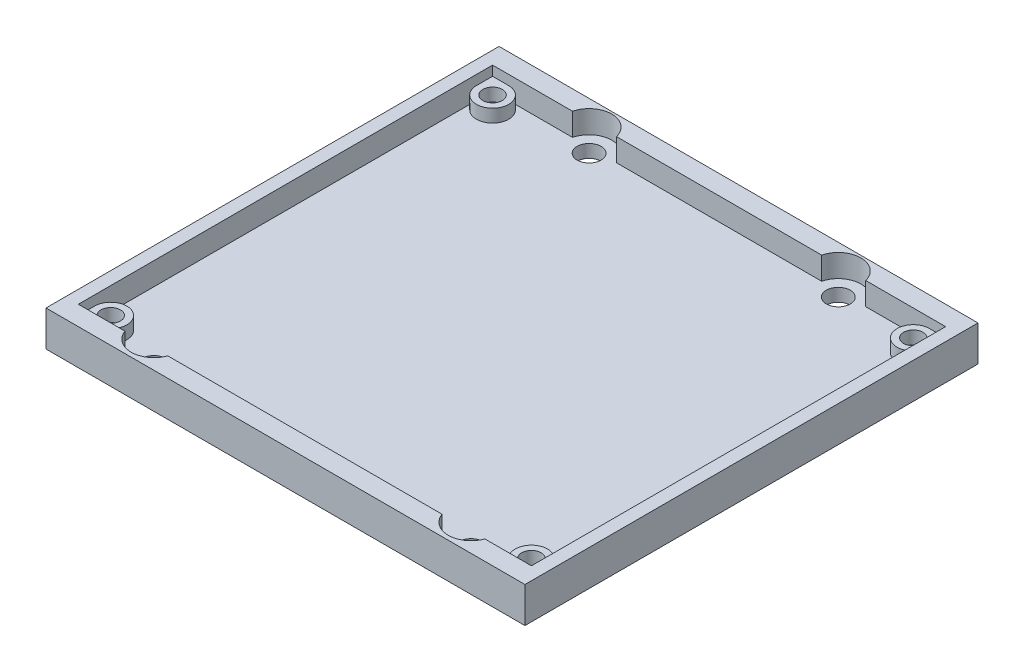
ISO-10303-21;
HEADER;
FILE_DESCRIPTION(('STEP AP214'),'2;1');
FILE_NAME('part.step','',(''),(''),'','','');
FILE_SCHEMA(('AUTOMOTIVE_DESIGN { 1 0 10303 214 1 1 1 1 }'));
ENDSEC;
DATA;
#1=APPLICATION_CONTEXT('core data for automotive mechanical design processes');
#2=APPLICATION_PROTOCOL_DEFINITION('international standard','automotive_design',2000,#1);
#3=PRODUCT_CONTEXT('',#1,'mechanical');
#4=PRODUCT('Part','Part','',(#3));
#5=PRODUCT_RELATED_PRODUCT_CATEGORY('part','',(#4));
#6=PRODUCT_DEFINITION_FORMATION('','',#4);
#7=PRODUCT_DEFINITION_CONTEXT('part definition',#1,'design');
#8=PRODUCT_DEFINITION('design','',#6,#7);
#9=PRODUCT_DEFINITION_SHAPE('','',#8);
#10=(LENGTH_UNIT() NAMED_UNIT(*) SI_UNIT(.MILLI.,.METRE.));
#11=(NAMED_UNIT(*) PLANE_ANGLE_UNIT() SI_UNIT($,.RADIAN.));
#12=(NAMED_UNIT(*) SI_UNIT($,.STERADIAN.) SOLID_ANGLE_UNIT());
#13=UNCERTAINTY_MEASURE_WITH_UNIT(LENGTH_MEASURE(1.E-05),#10,'distance_accuracy_value','');
#14=(GEOMETRIC_REPRESENTATION_CONTEXT(3) GLOBAL_UNCERTAINTY_ASSIGNED_CONTEXT((#13)) GLOBAL_UNIT_ASSIGNED_CONTEXT((#10,
#11,#12)) REPRESENTATION_CONTEXT('',''));
#15=CARTESIAN_POINT('',(0.,0.,0.));
#16=DIRECTION('',(0.,0.,1.));
#17=DIRECTION('',(1.,0.,0.));
#18=AXIS2_PLACEMENT_3D('',#15,#16,#17);
#19=CARTESIAN_POINT('',(0.,4.,0.));
#20=DIRECTION('',(0.,1.,0.));
#21=DIRECTION('',(0.,0.,1.));
#22=AXIS2_PLACEMENT_3D('',#19,#20,#21);
#23=PLANE('',#22);
#24=CARTESIAN_POINT('',(4.5,4.,-64.5));
#25=DIRECTION('',(0.,1.,0.));
#26=DIRECTION('',(0.,0.,1.));
#27=AXIS2_PLACEMENT_3D('',#24,#25,#26);
#28=CIRCLE('',#27,1.5);
#29=CARTESIAN_POINT('',(4.5,4.,-63.));
#30=VERTEX_POINT('',#29);
#31=EDGE_CURVE('E324',#30,#30,#28,.T.);
#32=ORIENTED_EDGE('',*,*,#31,.F.);
#33=EDGE_LOOP('',(#32));
#34=FACE_BOUND('',#33,.T.);
#35=CARTESIAN_POINT('',(4.5,4.,-64.5));
#36=DIRECTION('',(0.,1.,0.));
#37=DIRECTION('',(0.,0.,1.));
#38=AXIS2_PLACEMENT_3D('',#35,#36,#37);
#39=CIRCLE('',#38,2.5);
#40=CARTESIAN_POINT('',(4.5,4.,-67.));
#41=VERTEX_POINT('',#40);
#42=CARTESIAN_POINT('',(2.,4.,-64.5));
#43=VERTEX_POINT('',#42);
#44=EDGE_CURVE('E338',#41,#43,#39,.F.);
#45=ORIENTED_EDGE('',*,*,#44,.F.);
#46=DIRECTION('',(-1.,0.,0.));
#47=VECTOR('',#46,1.);
#48=CARTESIAN_POINT('',(4.5,4.,-67.));
#49=LINE('',#48,#47);
#50=CARTESIAN_POINT('',(1.99999999999999,4.,-67.));
#51=VERTEX_POINT('',#50);
#52=EDGE_CURVE('E11',#41,#51,#49,.T.);
#53=ORIENTED_EDGE('',*,*,#52,.T.);
#54=DIRECTION('',(0.,0.,1.));
#55=VECTOR('',#54,1.);
#56=CARTESIAN_POINT('',(1.99999999999999,4.,-3.00000000000002));
#57=LINE('',#56,#55);
#58=EDGE_CURVE('E222',#51,#43,#57,.T.);
#59=ORIENTED_EDGE('',*,*,#58,.T.);
#60=EDGE_LOOP('',(#45,#53,#59));
#61=FACE_BOUND('',#60,.T.);
#62=ADVANCED_FACE('F41',(#34,#61),#23,.T.);
#63=CARTESIAN_POINT('',(4.5,4.,-5.50000000000002));
#64=DIRECTION('',(0.,1.,0.));
#65=DIRECTION('',(0.,0.,1.));
#66=AXIS2_PLACEMENT_3D('',#63,#64,#65);
#67=CIRCLE('',#66,1.5);
#68=CARTESIAN_POINT('',(4.5,4.,-4.00000000000002));
#69=VERTEX_POINT('',#68);
#70=EDGE_CURVE('E311',#69,#69,#67,.T.);
#71=ORIENTED_EDGE('',*,*,#70,.F.);
#72=EDGE_LOOP('',(#71));
#73=FACE_BOUND('',#72,.T.);
#74=CARTESIAN_POINT('',(4.5,4.,-5.50000000000002));
#75=DIRECTION('',(0.,1.,0.));
#76=DIRECTION('',(0.,0.,1.));
#77=AXIS2_PLACEMENT_3D('',#74,#75,#76);
#78=CIRCLE('',#77,2.5);
#79=CARTESIAN_POINT('',(4.5,4.,-3.00000000000002));
#80=VERTEX_POINT('',#79);
#81=CARTESIAN_POINT('',(2.,4.,-5.50000000000002));
#82=VERTEX_POINT('',#81);
#83=EDGE_CURVE('E335',#80,#82,#78,.T.);
#84=ORIENTED_EDGE('',*,*,#83,.T.);
#85=CARTESIAN_POINT('',(1.99999999999999,4.,-3.00000000000002));
#86=VERTEX_POINT('',#85);
#87=EDGE_CURVE('E51',#82,#86,#57,.T.);
#88=ORIENTED_EDGE('',*,*,#87,.T.);
#89=DIRECTION('',(1.,0.,0.));
#90=VECTOR('',#89,1.);
#91=CARTESIAN_POINT('',(9.19808630126354,4.,-3.00000000000002));
#92=LINE('',#91,#90);
#93=EDGE_CURVE('E273',#86,#80,#92,.T.);
#94=ORIENTED_EDGE('',*,*,#93,.T.);
#95=EDGE_LOOP('',(#84,#88,#94));
#96=FACE_BOUND('',#95,.T.);
#97=ADVANCED_FACE('F594',(#73,#96),#23,.T.);
#98=CARTESIAN_POINT('',(69.5,4.,-5.50000000000002));
#99=DIRECTION('',(0.,1.,0.));
#100=DIRECTION('',(0.,0.,1.));
#101=AXIS2_PLACEMENT_3D('',#98,#99,#100);
#102=CIRCLE('',#101,1.5);
#103=CARTESIAN_POINT('',(69.5,4.,-4.00000000000003));
#104=VERTEX_POINT('',#103);
#105=EDGE_CURVE('E315',#104,#104,#102,.T.);
#106=ORIENTED_EDGE('',*,*,#105,.F.);
#107=EDGE_LOOP('',(#106));
#108=FACE_BOUND('',#107,.T.);
#109=CARTESIAN_POINT('',(69.5,4.,-5.50000000000002));
#110=DIRECTION('',(0.,1.,0.));
#111=DIRECTION('',(0.,0.,1.));
#112=AXIS2_PLACEMENT_3D('',#109,#110,#111);
#113=CIRCLE('',#112,2.5);
#114=CARTESIAN_POINT('',(69.5,4.,-3.00000000000002));
#115=VERTEX_POINT('',#114);
#116=CARTESIAN_POINT('',(72.,4.,-5.50000000000002));
#117=VERTEX_POINT('',#116);
#118=EDGE_CURVE('E331',#115,#117,#113,.F.);
#119=ORIENTED_EDGE('',*,*,#118,.F.);
#120=DIRECTION('',(1.,0.,0.));
#121=VECTOR('',#120,1.);
#122=CARTESIAN_POINT('',(72.,4.,-3.00000000000002));
#123=LINE('',#122,#121);
#124=CARTESIAN_POINT('',(72.,4.,-3.00000000000002));
#125=VERTEX_POINT('',#124);
#126=EDGE_CURVE('E277',#115,#125,#123,.T.);
#127=ORIENTED_EDGE('',*,*,#126,.T.);
#128=DIRECTION('',(0.,0.,-1.));
#129=VECTOR('',#128,1.);
#130=CARTESIAN_POINT('',(72.,4.,-67.));
#131=LINE('',#130,#129);
#132=EDGE_CURVE('E276',#125,#117,#131,.T.);
#133=ORIENTED_EDGE('',*,*,#132,.T.);
#134=EDGE_LOOP('',(#119,#127,#133));
#135=FACE_BOUND('',#134,.T.);
#136=ADVANCED_FACE('F561',(#108,#135),#23,.T.);
#137=CARTESIAN_POINT('',(69.5,4.,-64.5));
#138=DIRECTION('',(0.,1.,0.));
#139=DIRECTION('',(0.,0.,1.));
#140=AXIS2_PLACEMENT_3D('',#137,#138,#139);
#141=CIRCLE('',#140,1.5);
#142=CARTESIAN_POINT('',(69.5,4.,-63.));
#143=VERTEX_POINT('',#142);
#144=EDGE_CURVE('E320',#143,#143,#141,.T.);
#145=ORIENTED_EDGE('',*,*,#144,.F.);
#146=EDGE_LOOP('',(#145));
#147=FACE_BOUND('',#146,.T.);
#148=CARTESIAN_POINT('',(69.5,4.,-64.5));
#149=DIRECTION('',(0.,1.,0.));
#150=DIRECTION('',(0.,0.,1.));
#151=AXIS2_PLACEMENT_3D('',#148,#149,#150);
#152=CIRCLE('',#151,2.5);
#153=CARTESIAN_POINT('',(69.5,4.,-67.));
#154=VERTEX_POINT('',#153);
#155=CARTESIAN_POINT('',(72.,4.,-64.5));
#156=VERTEX_POINT('',#155);
#157=EDGE_CURVE('E328',#154,#156,#152,.T.);
#158=ORIENTED_EDGE('',*,*,#157,.T.);
#159=CARTESIAN_POINT('',(72.,4.,-67.));
#160=VERTEX_POINT('',#159);
#161=EDGE_CURVE('E280',#156,#160,#131,.T.);
#162=ORIENTED_EDGE('',*,*,#161,.T.);
#163=DIRECTION('',(-1.,0.,0.));
#164=VECTOR('',#163,1.);
#165=CARTESIAN_POINT('',(59.6478931377813,4.,-67.));
#166=LINE('',#165,#164);
#167=EDGE_CURVE('E215',#160,#154,#166,.T.);
#168=ORIENTED_EDGE('',*,*,#167,.T.);
#169=EDGE_LOOP('',(#158,#162,#168));
#170=FACE_BOUND('',#169,.T.);
#171=ADVANCED_FACE('F531',(#147,#170),#23,.T.);
#172=CARTESIAN_POINT('',(0.,2.,0.));
#173=DIRECTION('',(0.,-1.,0.));
#174=DIRECTION('',(0.,0.,-1.));
#175=AXIS2_PLACEMENT_3D('',#172,#173,#174);
#176=PLANE('',#175);
#177=DIRECTION('',(1.,0.,0.));
#178=VECTOR('',#177,1.);
#179=CARTESIAN_POINT('',(0.,2.,-67.));
#180=LINE('',#179,#178);
#181=CARTESIAN_POINT('',(21.1478931377812,2.,-67.));
#182=VERTEX_POINT('',#181);
#183=CARTESIAN_POINT('',(52.8521068622188,2.,-67.));
#184=VERTEX_POINT('',#183);
#185=EDGE_CURVE('E358',#182,#184,#180,.T.);
#186=ORIENTED_EDGE('',*,*,#185,.F.);
#187=CARTESIAN_POINT('',(17.75,2.,-66.1607609254693));
#188=DIRECTION('',(0.,1.,0.));
#189=DIRECTION('',(0.,0.,1.));
#190=AXIS2_PLACEMENT_3D('',#187,#188,#189);
#191=CIRCLE('',#190,3.5);
#192=CARTESIAN_POINT('',(14.3521068622187,2.,-67.));
#193=VERTEX_POINT('',#192);
#194=EDGE_CURVE('E316',#182,#193,#191,.T.);
#195=ORIENTED_EDGE('',*,*,#194,.T.);
#196=DIRECTION('',(1.,0.,0.));
#197=VECTOR('',#196,1.);
#198=CARTESIAN_POINT('',(0.,2.,-67.));
#199=LINE('',#198,#197);
#200=CARTESIAN_POINT('',(4.5,2.,-67.));
#201=VERTEX_POINT('',#200);
#202=EDGE_CURVE('E410',#201,#193,#199,.T.);
#203=ORIENTED_EDGE('',*,*,#202,.F.);
#204=CARTESIAN_POINT('',(4.5,2.,-64.5));
#205=DIRECTION('',(0.,1.,0.));
#206=DIRECTION('',(0.,0.,1.));
#207=AXIS2_PLACEMENT_3D('',#204,#205,#206);
#208=CIRCLE('',#207,2.5);
#209=CARTESIAN_POINT('',(2.,2.,-64.5));
#210=VERTEX_POINT('',#209);
#211=EDGE_CURVE('E406',#201,#210,#208,.F.);
#212=ORIENTED_EDGE('',*,*,#211,.T.);
#213=DIRECTION('',(0.,0.,-1.));
#214=VECTOR('',#213,1.);
#215=CARTESIAN_POINT('',(2.,2.,0.));
#216=LINE('',#215,#214);
#217=CARTESIAN_POINT('',(2.,2.,-5.50000000000002));
#218=VERTEX_POINT('',#217);
#219=EDGE_CURVE('E403',#218,#210,#216,.T.);
#220=ORIENTED_EDGE('',*,*,#219,.F.);
#221=CARTESIAN_POINT('',(4.5,2.,-5.50000000000002));
#222=DIRECTION('',(0.,1.,0.));
#223=DIRECTION('',(0.,0.,1.));
#224=AXIS2_PLACEMENT_3D('',#221,#222,#223);
#225=CIRCLE('',#224,2.5);
#226=CARTESIAN_POINT('',(4.5,2.,-3.00000000000002));
#227=VERTEX_POINT('',#226);
#228=EDGE_CURVE('E400',#227,#218,#225,.T.);
#229=ORIENTED_EDGE('',*,*,#228,.F.);
#230=DIRECTION('',(1.,0.,0.));
#231=VECTOR('',#230,1.);
#232=CARTESIAN_POINT('',(0.,2.,-3.00000000000002));
#233=LINE('',#232,#231);
#234=CARTESIAN_POINT('',(9.19808630126354,2.,-3.00000000000002));
#235=VERTEX_POINT('',#234);
#236=EDGE_CURVE('E396',#227,#235,#233,.T.);
#237=ORIENTED_EDGE('',*,*,#236,.T.);
#238=CARTESIAN_POINT('',(12.5,2.,-4.16076092546937));
#239=DIRECTION('',(0.,1.,0.));
#240=DIRECTION('',(0.,0.,1.));
#241=AXIS2_PLACEMENT_3D('',#238,#239,#240);
#242=CIRCLE('',#241,3.5);
#243=CARTESIAN_POINT('',(15.8019136987365,2.,-3.00000000000002));
#244=VERTEX_POINT('',#243);
#245=EDGE_CURVE('E392',#235,#244,#242,.T.);
#246=ORIENTED_EDGE('',*,*,#245,.T.);
#247=DIRECTION('',(1.,0.,0.));
#248=VECTOR('',#247,1.);
#249=CARTESIAN_POINT('',(0.,2.,-3.00000000000002));
#250=LINE('',#249,#248);
#251=CARTESIAN_POINT('',(58.1980863012635,2.,-3.00000000000002));
#252=VERTEX_POINT('',#251);
#253=EDGE_CURVE('E388',#244,#252,#250,.T.);
#254=ORIENTED_EDGE('',*,*,#253,.T.);
#255=CARTESIAN_POINT('',(61.5,2.,-4.16076092546937));
#256=DIRECTION('',(0.,1.,0.));
#257=DIRECTION('',(0.,0.,1.));
#258=AXIS2_PLACEMENT_3D('',#255,#256,#257);
#259=CIRCLE('',#258,3.5);
#260=CARTESIAN_POINT('',(64.8019136987365,2.,-3.00000000000002));
#261=VERTEX_POINT('',#260);
#262=EDGE_CURVE('E384',#261,#252,#259,.F.);
#263=ORIENTED_EDGE('',*,*,#262,.F.);
#264=DIRECTION('',(1.,0.,0.));
#265=VECTOR('',#264,1.);
#266=CARTESIAN_POINT('',(0.,2.,-3.00000000000001));
#267=LINE('',#266,#265);
#268=CARTESIAN_POINT('',(69.5,2.,-3.00000000000002));
#269=VERTEX_POINT('',#268);
#270=EDGE_CURVE('E380',#261,#269,#267,.T.);
#271=ORIENTED_EDGE('',*,*,#270,.T.);
#272=CARTESIAN_POINT('',(69.5,2.,-5.50000000000002));
#273=DIRECTION('',(0.,1.,0.));
#274=DIRECTION('',(0.,0.,1.));
#275=AXIS2_PLACEMENT_3D('',#272,#273,#274);
#276=CIRCLE('',#275,2.5);
#277=CARTESIAN_POINT('',(72.,2.,-5.50000000000002));
#278=VERTEX_POINT('',#277);
#279=EDGE_CURVE('E376',#269,#278,#276,.F.);
#280=ORIENTED_EDGE('',*,*,#279,.T.);
#281=DIRECTION('',(0.,0.,-1.));
#282=VECTOR('',#281,1.);
#283=CARTESIAN_POINT('',(72.,2.,0.));
#284=LINE('',#283,#282);
#285=CARTESIAN_POINT('',(72.,2.,-64.5));
#286=VERTEX_POINT('',#285);
#287=EDGE_CURVE('E372',#278,#286,#284,.T.);
#288=ORIENTED_EDGE('',*,*,#287,.T.);
#289=CARTESIAN_POINT('',(69.5,2.,-64.5));
#290=DIRECTION('',(0.,1.,0.));
#291=DIRECTION('',(0.,0.,1.));
#292=AXIS2_PLACEMENT_3D('',#289,#290,#291);
#293=CIRCLE('',#292,2.5);
#294=CARTESIAN_POINT('',(69.5,2.,-67.));
#295=VERTEX_POINT('',#294);
#296=EDGE_CURVE('E368',#295,#286,#293,.T.);
#297=ORIENTED_EDGE('',*,*,#296,.F.);
#298=DIRECTION('',(1.,0.,0.));
#299=VECTOR('',#298,1.);
#300=CARTESIAN_POINT('',(0.,2.,-67.));
#301=LINE('',#300,#299);
#302=CARTESIAN_POINT('',(59.6478931377813,2.,-67.));
#303=VERTEX_POINT('',#302);
#304=EDGE_CURVE('E365',#303,#295,#301,.T.);
#305=ORIENTED_EDGE('',*,*,#304,.F.);
#306=CARTESIAN_POINT('',(56.25,2.,-66.1607609254693));
#307=DIRECTION('',(0.,1.,0.));
#308=DIRECTION('',(0.,0.,1.));
#309=AXIS2_PLACEMENT_3D('',#306,#307,#308);
#310=CIRCLE('',#309,3.5);
#311=EDGE_CURVE('E362',#184,#303,#310,.F.);
#312=ORIENTED_EDGE('',*,*,#311,.F.);
#313=EDGE_LOOP('',(#186,#195,#203,#212,#220,#229,#237,#246,#254,#263,#271,#280,#288,#297,#305,#312));
#314=FACE_BOUND('',#313,.T.);
#315=CARTESIAN_POINT('',(17.75,2.,-66.1607609254693));
#316=DIRECTION('',(0.,1.,0.));
#317=DIRECTION('',(0.,0.,1.));
#318=AXIS2_PLACEMENT_3D('',#315,#316,#317);
#319=CIRCLE('',#318,1.85);
#320=CARTESIAN_POINT('',(17.75,2.,-64.3107609254693));
#321=VERTEX_POINT('',#320);
#322=EDGE_CURVE('E490',#321,#321,#319,.T.);
#323=ORIENTED_EDGE('',*,*,#322,.F.);
#324=EDGE_LOOP('',(#323));
#325=FACE_BOUND('',#324,.T.);
#326=CARTESIAN_POINT('',(12.5,2.,-4.16076092546937));
#327=DIRECTION('',(0.,1.,0.));
#328=DIRECTION('',(0.,0.,1.));
#329=AXIS2_PLACEMENT_3D('',#326,#327,#328);
#330=CIRCLE('',#329,1.85);
#331=CARTESIAN_POINT('',(12.5,2.,-2.31076092546937));
#332=VERTEX_POINT('',#331);
#333=EDGE_CURVE('E482',#332,#332,#330,.T.);
#334=ORIENTED_EDGE('',*,*,#333,.F.);
#335=EDGE_LOOP('',(#334));
#336=FACE_BOUND('',#335,.T.);
#337=CARTESIAN_POINT('',(61.5,2.,-4.16076092546937));
#338=DIRECTION('',(0.,1.,0.));
#339=DIRECTION('',(0.,0.,-1.));
#340=AXIS2_PLACEMENT_3D('',#337,#338,#339);
#341=CIRCLE('',#340,1.85000000000001);
#342=CARTESIAN_POINT('',(61.5,2.,-6.01076092546939));
#343=VERTEX_POINT('',#342);
#344=EDGE_CURVE('E474',#343,#343,#341,.T.);
#345=ORIENTED_EDGE('',*,*,#344,.F.);
#346=EDGE_LOOP('',(#345));
#347=FACE_BOUND('',#346,.T.);
#348=CARTESIAN_POINT('',(56.25,2.,-66.1607609254693));
#349=DIRECTION('',(0.,1.,0.));
#350=DIRECTION('',(0.,0.,-1.));
#351=AXIS2_PLACEMENT_3D('',#348,#349,#350);
#352=CIRCLE('',#351,1.85);
#353=CARTESIAN_POINT('',(56.25,2.,-68.0107609254693));
#354=VERTEX_POINT('',#353);
#355=EDGE_CURVE('E466',#354,#354,#352,.T.);
#356=ORIENTED_EDGE('',*,*,#355,.F.);
#357=EDGE_LOOP('',(#356));
#358=FACE_BOUND('',#357,.T.);
#359=ADVANCED_FACE('F550',(#314,#325,#336,#347,#358),#176,.F.);
#360=CARTESIAN_POINT('',(0.,0.,0.));
#361=DIRECTION('',(0.,-1.,0.));
#362=DIRECTION('',(0.,0.,-1.));
#363=AXIS2_PLACEMENT_3D('',#360,#361,#362);
#364=PLANE('',#363);
#365=CARTESIAN_POINT('',(61.5,0.,-4.16076092546937));
#366=DIRECTION('',(0.,1.,0.));
#367=DIRECTION('',(0.,0.,-1.));
#368=AXIS2_PLACEMENT_3D('',#365,#366,#367);
#369=CIRCLE('',#368,1.85000000000001);
#370=CARTESIAN_POINT('',(61.5,0.,-6.01076092546939));
#371=VERTEX_POINT('',#370);
#372=EDGE_CURVE('E470',#371,#371,#369,.T.);
#373=ORIENTED_EDGE('',*,*,#372,.T.);
#374=EDGE_LOOP('',(#373));
#375=FACE_BOUND('',#374,.T.);
#376=CARTESIAN_POINT('',(17.75,0.,-66.1607609254693));
#377=DIRECTION('',(0.,1.,0.));
#378=DIRECTION('',(0.,0.,1.));
#379=AXIS2_PLACEMENT_3D('',#376,#377,#378);
#380=CIRCLE('',#379,1.85);
#381=CARTESIAN_POINT('',(17.75,0.,-64.3107609254693));
#382=VERTEX_POINT('',#381);
#383=EDGE_CURVE('E486',#382,#382,#380,.T.);
#384=ORIENTED_EDGE('',*,*,#383,.T.);
#385=EDGE_LOOP('',(#384));
#386=FACE_BOUND('',#385,.T.);
#387=DIRECTION('',(0.,0.,1.));
#388=VECTOR('',#387,1.);
#389=CARTESIAN_POINT('',(0.,0.,0.));
#390=LINE('',#389,#388);
#391=CARTESIAN_POINT('',(0.,0.,-70.));
#392=VERTEX_POINT('',#391);
#393=CARTESIAN_POINT('',(0.,0.,0.));
#394=VERTEX_POINT('',#393);
#395=EDGE_CURVE('E494',#392,#394,#390,.T.);
#396=ORIENTED_EDGE('',*,*,#395,.F.);
#397=DIRECTION('',(-1.,0.,0.));
#398=VECTOR('',#397,1.);
#399=CARTESIAN_POINT('',(0.,0.,-70.));
#400=LINE('',#399,#398);
#401=CARTESIAN_POINT('',(74.,0.,-70.));
#402=VERTEX_POINT('',#401);
#403=EDGE_CURVE('E508',#402,#392,#400,.T.);
#404=ORIENTED_EDGE('',*,*,#403,.F.);
#405=DIRECTION('',(0.,0.,-1.));
#406=VECTOR('',#405,1.);
#407=CARTESIAN_POINT('',(74.,0.,0.));
#408=LINE('',#407,#406);
#409=CARTESIAN_POINT('',(74.,0.,0.));
#410=VERTEX_POINT('',#409);
#411=EDGE_CURVE('E504',#410,#402,#408,.T.);
#412=ORIENTED_EDGE('',*,*,#411,.F.);
#413=DIRECTION('',(1.,0.,0.));
#414=VECTOR('',#413,1.);
#415=CARTESIAN_POINT('',(0.,0.,0.));
#416=LINE('',#415,#414);
#417=EDGE_CURVE('E501',#394,#410,#416,.T.);
#418=ORIENTED_EDGE('',*,*,#417,.F.);
#419=EDGE_LOOP('',(#396,#404,#412,#418));
#420=FACE_BOUND('',#419,.T.);
#421=CARTESIAN_POINT('',(12.5,0.,-4.16076092546937));
#422=DIRECTION('',(0.,1.,0.));
#423=DIRECTION('',(0.,0.,1.));
#424=AXIS2_PLACEMENT_3D('',#421,#422,#423);
#425=CIRCLE('',#424,1.85);
#426=CARTESIAN_POINT('',(12.5,0.,-2.31076092546937));
#427=VERTEX_POINT('',#426);
#428=EDGE_CURVE('E478',#427,#427,#425,.T.);
#429=ORIENTED_EDGE('',*,*,#428,.T.);
#430=EDGE_LOOP('',(#429));
#431=FACE_BOUND('',#430,.T.);
#432=CARTESIAN_POINT('',(56.25,0.,-66.1607609254693));
#433=DIRECTION('',(0.,1.,0.));
#434=DIRECTION('',(0.,0.,-1.));
#435=AXIS2_PLACEMENT_3D('',#432,#433,#434);
#436=CIRCLE('',#435,1.85);
#437=CARTESIAN_POINT('',(56.25,0.,-68.0107609254693));
#438=VERTEX_POINT('',#437);
#439=EDGE_CURVE('E465',#438,#438,#436,.T.);
#440=ORIENTED_EDGE('',*,*,#439,.T.);
#441=EDGE_LOOP('',(#440));
#442=FACE_BOUND('',#441,.T.);
#443=ADVANCED_FACE('F608',(#375,#386,#420,#431,#442),#364,.T.);
#444=CARTESIAN_POINT('',(0.,2.,0.));
#445=DIRECTION('',(1.,0.,0.));
#446=DIRECTION('',(0.,0.,-1.));
#447=AXIS2_PLACEMENT_3D('',#444,#445,#446);
#448=PLANE('',#447);
#449=ORIENTED_EDGE('',*,*,#395,.T.);
#450=DIRECTION('',(0.,-1.,0.));
#451=VECTOR('',#450,1.);
#452=CARTESIAN_POINT('',(0.,2.,0.));
#453=LINE('',#452,#451);
#454=CARTESIAN_POINT('',(0.,5.5,0.));
#455=VERTEX_POINT('',#454);
#456=EDGE_CURVE('E45',#455,#394,#453,.T.);
#457=ORIENTED_EDGE('',*,*,#456,.F.);
#458=DIRECTION('',(0.,0.,1.));
#459=VECTOR('',#458,1.);
#460=CARTESIAN_POINT('',(0.,5.5,-70.));
#461=LINE('',#460,#459);
#462=CARTESIAN_POINT('',(0.,5.5,-70.));
#463=VERTEX_POINT('',#462);
#464=EDGE_CURVE('E224',#463,#455,#461,.T.);
#465=ORIENTED_EDGE('',*,*,#464,.F.);
#466=DIRECTION('',(0.,-1.,0.));
#467=VECTOR('',#466,1.);
#468=CARTESIAN_POINT('',(0.,2.,-70.));
#469=LINE('',#468,#467);
#470=EDGE_CURVE('E511',#463,#392,#469,.T.);
#471=ORIENTED_EDGE('',*,*,#470,.T.);
#472=EDGE_LOOP('',(#449,#457,#465,#471));
#473=FACE_BOUND('',#472,.T.);
#474=ADVANCED_FACE('F43',(#473),#448,.F.);
#475=CARTESIAN_POINT('',(0.,2.,0.));
#476=DIRECTION('',(0.,0.,-1.));
#477=DIRECTION('',(-1.,0.,0.));
#478=AXIS2_PLACEMENT_3D('',#475,#476,#477);
#479=PLANE('',#478);
#480=ORIENTED_EDGE('',*,*,#417,.T.);
#481=DIRECTION('',(0.,-1.,0.));
#482=VECTOR('',#481,1.);
#483=CARTESIAN_POINT('',(74.,2.,0.));
#484=LINE('',#483,#482);
#485=CARTESIAN_POINT('',(74.,5.5,0.));
#486=VERTEX_POINT('',#485);
#487=EDGE_CURVE('E518',#486,#410,#484,.T.);
#488=ORIENTED_EDGE('',*,*,#487,.F.);
#489=DIRECTION('',(1.,0.,0.));
#490=VECTOR('',#489,1.);
#491=CARTESIAN_POINT('',(0.,5.5,0.));
#492=LINE('',#491,#490);
#493=EDGE_CURVE('E298',#455,#486,#492,.T.);
#494=ORIENTED_EDGE('',*,*,#493,.F.);
#495=ORIENTED_EDGE('',*,*,#456,.T.);
#496=EDGE_LOOP('',(#480,#488,#494,#495));
#497=FACE_BOUND('',#496,.T.);
#498=ADVANCED_FACE('F641',(#497),#479,.F.);
#499=CARTESIAN_POINT('',(74.,2.,0.));
#500=DIRECTION('',(-1.,0.,0.));
#501=DIRECTION('',(0.,0.,1.));
#502=AXIS2_PLACEMENT_3D('',#499,#500,#501);
#503=PLANE('',#502);
#504=ORIENTED_EDGE('',*,*,#411,.T.);
#505=DIRECTION('',(0.,-1.,0.));
#506=VECTOR('',#505,1.);
#507=CARTESIAN_POINT('',(74.,2.,-70.));
#508=LINE('',#507,#506);
#509=CARTESIAN_POINT('',(74.,5.5,-70.));
#510=VERTEX_POINT('',#509);
#511=EDGE_CURVE('E515',#510,#402,#508,.T.);
#512=ORIENTED_EDGE('',*,*,#511,.F.);
#513=DIRECTION('',(0.,0.,-1.));
#514=VECTOR('',#513,1.);
#515=CARTESIAN_POINT('',(74.,5.5,-70.));
#516=LINE('',#515,#514);
#517=EDGE_CURVE('E302',#486,#510,#516,.T.);
#518=ORIENTED_EDGE('',*,*,#517,.F.);
#519=ORIENTED_EDGE('',*,*,#487,.T.);
#520=EDGE_LOOP('',(#504,#512,#518,#519));
#521=FACE_BOUND('',#520,.T.);
#522=ADVANCED_FACE('F638',(#521),#503,.F.);
#523=CARTESIAN_POINT('',(0.,2.,-70.));
#524=DIRECTION('',(0.,0.,1.));
#525=DIRECTION('',(1.,0.,0.));
#526=AXIS2_PLACEMENT_3D('',#523,#524,#525);
#527=PLANE('',#526);
#528=ORIENTED_EDGE('',*,*,#403,.T.);
#529=ORIENTED_EDGE('',*,*,#470,.F.);
#530=DIRECTION('',(-1.,0.,0.));
#531=VECTOR('',#530,1.);
#532=CARTESIAN_POINT('',(0.,5.5,-70.));
#533=LINE('',#532,#531);
#534=EDGE_CURVE('E306',#510,#463,#533,.T.);
#535=ORIENTED_EDGE('',*,*,#534,.F.);
#536=ORIENTED_EDGE('',*,*,#511,.T.);
#537=EDGE_LOOP('',(#528,#529,#535,#536));
#538=FACE_BOUND('',#537,.T.);
#539=ADVANCED_FACE('F635',(#538),#527,.F.);
#540=CARTESIAN_POINT('',(17.75,2.,-66.1607609254693));
#541=DIRECTION('',(0.,-1.,0.));
#542=DIRECTION('',(0.,0.,-1.));
#543=AXIS2_PLACEMENT_3D('',#540,#541,#542);
#544=CYLINDRICAL_SURFACE('',#543,1.85);
#545=ORIENTED_EDGE('',*,*,#322,.T.);
#546=EDGE_LOOP('',(#545));
#547=FACE_BOUND('',#546,.T.);
#548=ORIENTED_EDGE('',*,*,#383,.F.);
#549=EDGE_LOOP('',(#548));
#550=FACE_BOUND('',#549,.T.);
#551=ADVANCED_FACE('F630',(#547,#550),#544,.F.);
#552=CARTESIAN_POINT('',(12.5,2.,-4.16076092546937));
#553=DIRECTION('',(0.,-1.,0.));
#554=DIRECTION('',(0.,0.,-1.));
#555=AXIS2_PLACEMENT_3D('',#552,#553,#554);
#556=CYLINDRICAL_SURFACE('',#555,1.85);
#557=ORIENTED_EDGE('',*,*,#333,.T.);
#558=EDGE_LOOP('',(#557));
#559=FACE_BOUND('',#558,.T.);
#560=ORIENTED_EDGE('',*,*,#428,.F.);
#561=EDGE_LOOP('',(#560));
#562=FACE_BOUND('',#561,.T.);
#563=ADVANCED_FACE('F939',(#559,#562),#556,.F.);
#564=CARTESIAN_POINT('',(61.5,2.,-4.16076092546937));
#565=DIRECTION('',(0.,-1.,0.));
#566=DIRECTION('',(0.,0.,-1.));
#567=AXIS2_PLACEMENT_3D('',#564,#565,#566);
#568=CYLINDRICAL_SURFACE('',#567,1.85000000000001);
#569=ORIENTED_EDGE('',*,*,#344,.T.);
#570=EDGE_LOOP('',(#569));
#571=FACE_BOUND('',#570,.T.);
#572=ORIENTED_EDGE('',*,*,#372,.F.);
#573=EDGE_LOOP('',(#572));
#574=FACE_BOUND('',#573,.T.);
#575=ADVANCED_FACE('F928',(#571,#574),#568,.F.);
#576=CARTESIAN_POINT('',(56.25,2.,-66.1607609254693));
#577=DIRECTION('',(0.,-1.,0.));
#578=DIRECTION('',(0.,0.,-1.));
#579=AXIS2_PLACEMENT_3D('',#576,#577,#578);
#580=CYLINDRICAL_SURFACE('',#579,1.85);
#581=ORIENTED_EDGE('',*,*,#355,.T.);
#582=EDGE_LOOP('',(#581));
#583=FACE_BOUND('',#582,.T.);
#584=ORIENTED_EDGE('',*,*,#439,.F.);
#585=EDGE_LOOP('',(#584));
#586=FACE_BOUND('',#585,.T.);
#587=ADVANCED_FACE('F727',(#583,#586),#580,.F.);
#588=CARTESIAN_POINT('',(0.,4.,-67.));
#589=DIRECTION('',(0.,0.,-1.));
#590=DIRECTION('',(-1.,0.,0.));
#591=AXIS2_PLACEMENT_3D('',#588,#589,#590);
#592=PLANE('',#591);
#593=ORIENTED_EDGE('',*,*,#185,.T.);
#594=DIRECTION('',(0.,-1.,0.));
#595=VECTOR('',#594,1.);
#596=CARTESIAN_POINT('',(52.8521068622188,4.,-67.));
#597=LINE('',#596,#595);
#598=CARTESIAN_POINT('',(52.8521068622187,5.5,-67.));
#599=VERTEX_POINT('',#598);
#600=EDGE_CURVE('E462',#599,#184,#597,.T.);
#601=ORIENTED_EDGE('',*,*,#600,.F.);
#602=DIRECTION('',(-1.,0.,0.));
#603=VECTOR('',#602,1.);
#604=CARTESIAN_POINT('',(21.1478931377812,5.5,-67.));
#605=LINE('',#604,#603);
#606=CARTESIAN_POINT('',(21.1478931377812,5.5,-67.));
#607=VERTEX_POINT('',#606);
#608=EDGE_CURVE('E263',#599,#607,#605,.T.);
#609=ORIENTED_EDGE('',*,*,#608,.T.);
#610=DIRECTION('',(0.,-1.,0.));
#611=VECTOR('',#610,1.);
#612=CARTESIAN_POINT('',(21.1478931377812,4.,-67.));
#613=LINE('',#612,#611);
#614=EDGE_CURVE('E342',#607,#182,#613,.T.);
#615=ORIENTED_EDGE('',*,*,#614,.T.);
#616=EDGE_LOOP('',(#593,#601,#609,#615));
#617=FACE_BOUND('',#616,.T.);
#618=ADVANCED_FACE('F574',(#617),#592,.F.);
#619=CARTESIAN_POINT('',(56.25,4.,-66.1607609254693));
#620=DIRECTION('',(0.,-1.,0.));
#621=DIRECTION('',(0.,0.,-1.));
#622=AXIS2_PLACEMENT_3D('',#619,#620,#621);
#623=CYLINDRICAL_SURFACE('',#622,3.5);
#624=ORIENTED_EDGE('',*,*,#311,.T.);
#625=DIRECTION('',(0.,-1.,0.));
#626=VECTOR('',#625,1.);
#627=CARTESIAN_POINT('',(59.6478931377813,4.,-67.));
#628=LINE('',#627,#626);
#629=CARTESIAN_POINT('',(59.6478931377813,5.5,-67.));
#630=VERTEX_POINT('',#629);
#631=EDGE_CURVE('E458',#630,#303,#628,.T.);
#632=ORIENTED_EDGE('',*,*,#631,.F.);
#633=CARTESIAN_POINT('',(56.25,5.5,-66.1607609254693));
#634=DIRECTION('',(0.,1.,0.));
#635=DIRECTION('',(0.,0.,1.));
#636=AXIS2_PLACEMENT_3D('',#633,#634,#635);
#637=CIRCLE('',#636,3.50000000000001);
#638=EDGE_CURVE('E259',#630,#599,#637,.T.);
#639=ORIENTED_EDGE('',*,*,#638,.T.);
#640=ORIENTED_EDGE('',*,*,#600,.T.);
#641=EDGE_LOOP('',(#624,#632,#639,#640));
#642=FACE_BOUND('',#641,.T.);
#643=ADVANCED_FACE('F570',(#642),#623,.F.);
#644=CARTESIAN_POINT('',(0.,4.,-67.));
#645=DIRECTION('',(0.,0.,-1.));
#646=DIRECTION('',(-1.,0.,0.));
#647=AXIS2_PLACEMENT_3D('',#644,#645,#646);
#648=PLANE('',#647);
#649=ORIENTED_EDGE('',*,*,#304,.T.);
#650=DIRECTION('',(0.,-1.,0.));
#651=VECTOR('',#650,1.);
#652=CARTESIAN_POINT('',(69.5,4.,-67.));
#653=LINE('',#652,#651);
#654=EDGE_CURVE('E454',#154,#295,#653,.T.);
#655=ORIENTED_EDGE('',*,*,#654,.F.);
#656=ORIENTED_EDGE('',*,*,#167,.F.);
#657=DIRECTION('',(0.,-1.,0.));
#658=VECTOR('',#657,1.);
#659=CARTESIAN_POINT('',(72.,5.5,-67.));
#660=LINE('',#659,#658);
#661=CARTESIAN_POINT('',(72.,5.5,-67.));
#662=VERTEX_POINT('',#661);
#663=EDGE_CURVE('E269',#662,#160,#660,.T.);
#664=ORIENTED_EDGE('',*,*,#663,.F.);
#665=DIRECTION('',(-1.,0.,0.));
#666=VECTOR('',#665,1.);
#667=CARTESIAN_POINT('',(59.6478931377813,5.5,-67.));
#668=LINE('',#667,#666);
#669=EDGE_CURVE('E255',#662,#630,#668,.T.);
#670=ORIENTED_EDGE('',*,*,#669,.T.);
#671=ORIENTED_EDGE('',*,*,#631,.T.);
#672=EDGE_LOOP('',(#649,#655,#656,#664,#670,#671));
#673=FACE_BOUND('',#672,.T.);
#674=ADVANCED_FACE('F543',(#673),#648,.F.);
#675=CARTESIAN_POINT('',(69.5,4.,-64.5));
#676=DIRECTION('',(0.,-1.,0.));
#677=DIRECTION('',(0.,0.,-1.));
#678=AXIS2_PLACEMENT_3D('',#675,#676,#677);
#679=CYLINDRICAL_SURFACE('',#678,2.5);
#680=ORIENTED_EDGE('',*,*,#296,.T.);
#681=DIRECTION('',(0.,-1.,0.));
#682=VECTOR('',#681,1.);
#683=CARTESIAN_POINT('',(72.,4.,-64.5));
#684=LINE('',#683,#682);
#685=EDGE_CURVE('E451',#156,#286,#684,.T.);
#686=ORIENTED_EDGE('',*,*,#685,.F.);
#687=ORIENTED_EDGE('',*,*,#157,.F.);
#688=ORIENTED_EDGE('',*,*,#654,.T.);
#689=EDGE_LOOP('',(#680,#686,#687,#688));
#690=FACE_BOUND('',#689,.T.);
#691=ADVANCED_FACE('F547',(#690),#679,.T.);
#692=CARTESIAN_POINT('',(72.,4.,0.));
#693=DIRECTION('',(-1.,0.,0.));
#694=DIRECTION('',(0.,0.,1.));
#695=AXIS2_PLACEMENT_3D('',#692,#693,#694);
#696=PLANE('',#695);
#697=ORIENTED_EDGE('',*,*,#287,.F.);
#698=DIRECTION('',(0.,-1.,0.));
#699=VECTOR('',#698,1.);
#700=CARTESIAN_POINT('',(72.,4.,-5.50000000000002));
#701=LINE('',#700,#699);
#702=EDGE_CURVE('E448',#117,#278,#701,.T.);
#703=ORIENTED_EDGE('',*,*,#702,.F.);
#704=ORIENTED_EDGE('',*,*,#132,.F.);
#705=DIRECTION('',(0.,-1.,0.));
#706=VECTOR('',#705,1.);
#707=CARTESIAN_POINT('',(72.,5.5,-3.00000000000002));
#708=LINE('',#707,#706);
#709=CARTESIAN_POINT('',(72.,5.5,-3.00000000000002));
#710=VERTEX_POINT('',#709);
#711=EDGE_CURVE('E289',#710,#125,#708,.T.);
#712=ORIENTED_EDGE('',*,*,#711,.F.);
#713=DIRECTION('',(0.,0.,-1.));
#714=VECTOR('',#713,1.);
#715=CARTESIAN_POINT('',(72.,5.5,-3.00000000000002));
#716=LINE('',#715,#714);
#717=EDGE_CURVE('E252',#710,#662,#716,.T.);
#718=ORIENTED_EDGE('',*,*,#717,.T.);
#719=ORIENTED_EDGE('',*,*,#663,.T.);
#720=ORIENTED_EDGE('',*,*,#161,.F.);
#721=ORIENTED_EDGE('',*,*,#685,.T.);
#722=EDGE_LOOP('',(#697,#703,#704,#712,#718,#719,#720,#721));
#723=FACE_BOUND('',#722,.T.);
#724=ADVANCED_FACE('F537',(#723),#696,.T.);
#725=CARTESIAN_POINT('',(69.5,4.,-5.50000000000002));
#726=DIRECTION('',(0.,-1.,0.));
#727=DIRECTION('',(0.,0.,-1.));
#728=AXIS2_PLACEMENT_3D('',#725,#726,#727);
#729=CYLINDRICAL_SURFACE('',#728,2.5);
#730=ORIENTED_EDGE('',*,*,#279,.F.);
#731=DIRECTION('',(0.,-1.,0.));
#732=VECTOR('',#731,1.);
#733=CARTESIAN_POINT('',(69.5,4.,-3.00000000000002));
#734=LINE('',#733,#732);
#735=EDGE_CURVE('E445',#115,#269,#734,.T.);
#736=ORIENTED_EDGE('',*,*,#735,.F.);
#737=ORIENTED_EDGE('',*,*,#118,.T.);
#738=ORIENTED_EDGE('',*,*,#702,.T.);
#739=EDGE_LOOP('',(#730,#736,#737,#738));
#740=FACE_BOUND('',#739,.T.);
#741=ADVANCED_FACE('F558',(#740),#729,.T.);
#742=CARTESIAN_POINT('',(0.,4.,-3.00000000000001));
#743=DIRECTION('',(0.,0.,-1.));
#744=DIRECTION('',(-1.,0.,0.));
#745=AXIS2_PLACEMENT_3D('',#742,#743,#744);
#746=PLANE('',#745);
#747=ORIENTED_EDGE('',*,*,#270,.F.);
#748=DIRECTION('',(0.,-1.,0.));
#749=VECTOR('',#748,1.);
#750=CARTESIAN_POINT('',(64.8019136987365,4.,-3.00000000000002));
#751=LINE('',#750,#749);
#752=CARTESIAN_POINT('',(64.8019136987365,5.5,-3.00000000000001));
#753=VERTEX_POINT('',#752);
#754=EDGE_CURVE('E442',#753,#261,#751,.T.);
#755=ORIENTED_EDGE('',*,*,#754,.F.);
#756=DIRECTION('',(1.,0.,0.));
#757=VECTOR('',#756,1.);
#758=CARTESIAN_POINT('',(72.,5.5,-3.00000000000002));
#759=LINE('',#758,#757);
#760=EDGE_CURVE('E249',#753,#710,#759,.T.);
#761=ORIENTED_EDGE('',*,*,#760,.T.);
#762=ORIENTED_EDGE('',*,*,#711,.T.);
#763=ORIENTED_EDGE('',*,*,#126,.F.);
#764=ORIENTED_EDGE('',*,*,#735,.T.);
#765=EDGE_LOOP('',(#747,#755,#761,#762,#763,#764));
#766=FACE_BOUND('',#765,.T.);
#767=ADVANCED_FACE('F564',(#766),#746,.T.);
#768=CARTESIAN_POINT('',(61.5,4.,-4.16076092546937));
#769=DIRECTION('',(0.,-1.,0.));
#770=DIRECTION('',(0.,0.,-1.));
#771=AXIS2_PLACEMENT_3D('',#768,#769,#770);
#772=CYLINDRICAL_SURFACE('',#771,3.5);
#773=ORIENTED_EDGE('',*,*,#262,.T.);
#774=DIRECTION('',(0.,-1.,0.));
#775=VECTOR('',#774,1.);
#776=CARTESIAN_POINT('',(58.1980863012635,4.,-3.00000000000002));
#777=LINE('',#776,#775);
#778=CARTESIAN_POINT('',(58.1980863012635,5.5,-3.00000000000002));
#779=VERTEX_POINT('',#778);
#780=EDGE_CURVE('E439',#779,#252,#777,.T.);
#781=ORIENTED_EDGE('',*,*,#780,.F.);
#782=CARTESIAN_POINT('',(61.5,5.5,-4.16076092546937));
#783=DIRECTION('',(0.,1.,0.));
#784=DIRECTION('',(0.,0.,1.));
#785=AXIS2_PLACEMENT_3D('',#782,#783,#784);
#786=CIRCLE('',#785,3.5);
#787=EDGE_CURVE('E245',#779,#753,#786,.T.);
#788=ORIENTED_EDGE('',*,*,#787,.T.);
#789=ORIENTED_EDGE('',*,*,#754,.T.);
#790=EDGE_LOOP('',(#773,#781,#788,#789));
#791=FACE_BOUND('',#790,.T.);
#792=ADVANCED_FACE('F783',(#791),#772,.F.);
#793=CARTESIAN_POINT('',(0.,4.,-3.00000000000002));
#794=DIRECTION('',(0.,0.,-1.));
#795=DIRECTION('',(-1.,0.,0.));
#796=AXIS2_PLACEMENT_3D('',#793,#794,#795);
#797=PLANE('',#796);
#798=ORIENTED_EDGE('',*,*,#253,.F.);
#799=DIRECTION('',(0.,-1.,0.));
#800=VECTOR('',#799,1.);
#801=CARTESIAN_POINT('',(15.8019136987365,4.,-3.00000000000002));
#802=LINE('',#801,#800);
#803=CARTESIAN_POINT('',(15.8019136987365,5.5,-3.00000000000002));
#804=VERTEX_POINT('',#803);
#805=EDGE_CURVE('E436',#804,#244,#802,.T.);
#806=ORIENTED_EDGE('',*,*,#805,.F.);
#807=DIRECTION('',(1.,0.,0.));
#808=VECTOR('',#807,1.);
#809=CARTESIAN_POINT('',(58.1980863012635,5.5,-3.00000000000002));
#810=LINE('',#809,#808);
#811=EDGE_CURVE('E241',#804,#779,#810,.T.);
#812=ORIENTED_EDGE('',*,*,#811,.T.);
#813=ORIENTED_EDGE('',*,*,#780,.T.);
#814=EDGE_LOOP('',(#798,#806,#812,#813));
#815=FACE_BOUND('',#814,.T.);
#816=ADVANCED_FACE('F792',(#815),#797,.T.);
#817=CARTESIAN_POINT('',(12.5,4.,-4.16076092546937));
#818=DIRECTION('',(0.,-1.,0.));
#819=DIRECTION('',(0.,0.,-1.));
#820=AXIS2_PLACEMENT_3D('',#817,#818,#819);
#821=CYLINDRICAL_SURFACE('',#820,3.5);
#822=ORIENTED_EDGE('',*,*,#245,.F.);
#823=DIRECTION('',(0.,-1.,0.));
#824=VECTOR('',#823,1.);
#825=CARTESIAN_POINT('',(9.19808630126354,4.,-3.00000000000002));
#826=LINE('',#825,#824);
#827=CARTESIAN_POINT('',(9.19808630126354,5.5,-3.00000000000002));
#828=VERTEX_POINT('',#827);
#829=EDGE_CURVE('E433',#828,#235,#826,.T.);
#830=ORIENTED_EDGE('',*,*,#829,.F.);
#831=CARTESIAN_POINT('',(12.5,5.5,-4.16076092546937));
#832=DIRECTION('',(0.,1.,0.));
#833=DIRECTION('',(0.,0.,1.));
#834=AXIS2_PLACEMENT_3D('',#831,#832,#833);
#835=CIRCLE('',#834,3.5);
#836=EDGE_CURVE('E235',#828,#804,#835,.T.);
#837=ORIENTED_EDGE('',*,*,#836,.T.);
#838=ORIENTED_EDGE('',*,*,#805,.T.);
#839=EDGE_LOOP('',(#822,#830,#837,#838));
#840=FACE_BOUND('',#839,.T.);
#841=ADVANCED_FACE('F803',(#840),#821,.F.);
#842=CARTESIAN_POINT('',(0.,4.,-3.00000000000002));
#843=DIRECTION('',(0.,0.,-1.));
#844=DIRECTION('',(-1.,0.,0.));
#845=AXIS2_PLACEMENT_3D('',#842,#843,#844);
#846=PLANE('',#845);
#847=ORIENTED_EDGE('',*,*,#236,.F.);
#848=DIRECTION('',(0.,-1.,0.));
#849=VECTOR('',#848,1.);
#850=CARTESIAN_POINT('',(4.5,4.,-3.00000000000002));
#851=LINE('',#850,#849);
#852=EDGE_CURVE('E430',#80,#227,#851,.T.);
#853=ORIENTED_EDGE('',*,*,#852,.F.);
#854=ORIENTED_EDGE('',*,*,#93,.F.);
#855=DIRECTION('',(0.,-1.,0.));
#856=VECTOR('',#855,1.);
#857=CARTESIAN_POINT('',(1.99999999999999,5.5,-3.00000000000002));
#858=LINE('',#857,#856);
#859=CARTESIAN_POINT('',(1.99999999999999,5.5,-3.00000000000002));
#860=VERTEX_POINT('',#859);
#861=EDGE_CURVE('E225',#860,#86,#858,.T.);
#862=ORIENTED_EDGE('',*,*,#861,.F.);
#863=DIRECTION('',(1.,0.,0.));
#864=VECTOR('',#863,1.);
#865=CARTESIAN_POINT('',(9.19808630126354,5.5,-3.00000000000002));
#866=LINE('',#865,#864);
#867=EDGE_CURVE('E231',#860,#828,#866,.T.);
#868=ORIENTED_EDGE('',*,*,#867,.T.);
#869=ORIENTED_EDGE('',*,*,#829,.T.);
#870=EDGE_LOOP('',(#847,#853,#854,#862,#868,#869));
#871=FACE_BOUND('',#870,.T.);
#872=ADVANCED_FACE('F814',(#871),#846,.T.);
#873=CARTESIAN_POINT('',(4.5,4.,-5.50000000000002));
#874=DIRECTION('',(0.,-1.,0.));
#875=DIRECTION('',(0.,0.,-1.));
#876=AXIS2_PLACEMENT_3D('',#873,#874,#875);
#877=CYLINDRICAL_SURFACE('',#876,2.5);
#878=ORIENTED_EDGE('',*,*,#228,.T.);
#879=DIRECTION('',(0.,-1.,0.));
#880=VECTOR('',#879,1.);
#881=CARTESIAN_POINT('',(2.,4.,-5.50000000000002));
#882=LINE('',#881,#880);
#883=EDGE_CURVE('E426',#82,#218,#882,.T.);
#884=ORIENTED_EDGE('',*,*,#883,.F.);
#885=ORIENTED_EDGE('',*,*,#83,.F.);
#886=ORIENTED_EDGE('',*,*,#852,.T.);
#887=EDGE_LOOP('',(#878,#884,#885,#886));
#888=FACE_BOUND('',#887,.T.);
#889=ADVANCED_FACE('F825',(#888),#877,.T.);
#890=CARTESIAN_POINT('',(2.,4.,0.));
#891=DIRECTION('',(-1.,0.,0.));
#892=DIRECTION('',(0.,0.,1.));
#893=AXIS2_PLACEMENT_3D('',#890,#891,#892);
#894=PLANE('',#893);
#895=ORIENTED_EDGE('',*,*,#219,.T.);
#896=DIRECTION('',(0.,-1.,0.));
#897=VECTOR('',#896,1.);
#898=CARTESIAN_POINT('',(2.,4.,-64.5));
#899=LINE('',#898,#897);
#900=EDGE_CURVE('E423',#43,#210,#899,.T.);
#901=ORIENTED_EDGE('',*,*,#900,.F.);
#902=ORIENTED_EDGE('',*,*,#58,.F.);
#903=DIRECTION('',(0.,-1.,0.));
#904=VECTOR('',#903,1.);
#905=CARTESIAN_POINT('',(1.99999999999999,5.5,-67.));
#906=LINE('',#905,#904);
#907=CARTESIAN_POINT('',(1.99999999999999,5.5,-67.));
#908=VERTEX_POINT('',#907);
#909=EDGE_CURVE('E205',#908,#51,#906,.T.);
#910=ORIENTED_EDGE('',*,*,#909,.F.);
#911=DIRECTION('',(0.,0.,1.));
#912=VECTOR('',#911,1.);
#913=CARTESIAN_POINT('',(1.99999999999999,5.5,-3.00000000000002));
#914=LINE('',#913,#912);
#915=EDGE_CURVE('E214',#908,#860,#914,.T.);
#916=ORIENTED_EDGE('',*,*,#915,.T.);
#917=ORIENTED_EDGE('',*,*,#861,.T.);
#918=ORIENTED_EDGE('',*,*,#87,.F.);
#919=ORIENTED_EDGE('',*,*,#883,.T.);
#920=EDGE_LOOP('',(#895,#901,#902,#910,#916,#917,#918,#919));
#921=FACE_BOUND('',#920,.T.);
#922=ADVANCED_FACE('F219',(#921),#894,.F.);
#923=CARTESIAN_POINT('',(4.5,4.,-64.5));
#924=DIRECTION('',(0.,-1.,0.));
#925=DIRECTION('',(0.,0.,-1.));
#926=AXIS2_PLACEMENT_3D('',#923,#924,#925);
#927=CYLINDRICAL_SURFACE('',#926,2.5);
#928=ORIENTED_EDGE('',*,*,#211,.F.);
#929=DIRECTION('',(0.,-1.,0.));
#930=VECTOR('',#929,1.);
#931=CARTESIAN_POINT('',(4.5,4.,-67.));
#932=LINE('',#931,#930);
#933=EDGE_CURVE('E420',#41,#201,#932,.T.);
#934=ORIENTED_EDGE('',*,*,#933,.F.);
#935=ORIENTED_EDGE('',*,*,#44,.T.);
#936=ORIENTED_EDGE('',*,*,#900,.T.);
#937=EDGE_LOOP('',(#928,#934,#935,#936));
#938=FACE_BOUND('',#937,.T.);
#939=ADVANCED_FACE('F846',(#938),#927,.T.);
#940=CARTESIAN_POINT('',(0.,4.,-67.));
#941=DIRECTION('',(0.,0.,-1.));
#942=DIRECTION('',(-1.,0.,0.));
#943=AXIS2_PLACEMENT_3D('',#940,#941,#942);
#944=PLANE('',#943);
#945=ORIENTED_EDGE('',*,*,#202,.T.);
#946=DIRECTION('',(0.,-1.,0.));
#947=VECTOR('',#946,1.);
#948=CARTESIAN_POINT('',(14.3521068622187,4.,-67.));
#949=LINE('',#948,#947);
#950=CARTESIAN_POINT('',(14.3521068622187,5.5,-67.));
#951=VERTEX_POINT('',#950);
#952=EDGE_CURVE('E208',#951,#193,#949,.T.);
#953=ORIENTED_EDGE('',*,*,#952,.F.);
#954=DIRECTION('',(-1.,0.,0.));
#955=VECTOR('',#954,1.);
#956=CARTESIAN_POINT('',(4.5,5.5,-67.));
#957=LINE('',#956,#955);
#958=EDGE_CURVE('E202',#951,#908,#957,.T.);
#959=ORIENTED_EDGE('',*,*,#958,.T.);
#960=ORIENTED_EDGE('',*,*,#909,.T.);
#961=ORIENTED_EDGE('',*,*,#52,.F.);
#962=ORIENTED_EDGE('',*,*,#933,.T.);
#963=EDGE_LOOP('',(#945,#953,#959,#960,#961,#962));
#964=FACE_BOUND('',#963,.T.);
#965=ADVANCED_FACE('F204',(#964),#944,.F.);
#966=CARTESIAN_POINT('',(4.5,4.,-64.5));
#967=DIRECTION('',(0.,-1.,0.));
#968=DIRECTION('',(0.,0.,-1.));
#969=AXIS2_PLACEMENT_3D('',#966,#967,#968);
#970=CYLINDRICAL_SURFACE('',#969,1.5);
#971=ORIENTED_EDGE('',*,*,#31,.T.);
#972=EDGE_LOOP('',(#971));
#973=FACE_BOUND('',#972,.T.);
#974=CARTESIAN_POINT('',(4.5,2.,-64.5));
#975=DIRECTION('',(0.,1.,0.));
#976=DIRECTION('',(0.,0.,1.));
#977=AXIS2_PLACEMENT_3D('',#974,#975,#976);
#978=CIRCLE('',#977,1.5);
#979=CARTESIAN_POINT('',(4.5,2.,-63.));
#980=VERTEX_POINT('',#979);
#981=EDGE_CURVE('E354',#980,#980,#978,.T.);
#982=ORIENTED_EDGE('',*,*,#981,.F.);
#983=EDGE_LOOP('',(#982));
#984=FACE_BOUND('',#983,.T.);
#985=ADVANCED_FACE('F616',(#973,#984),#970,.F.);
#986=CARTESIAN_POINT('',(69.5,4.,-64.5));
#987=DIRECTION('',(0.,-1.,0.));
#988=DIRECTION('',(0.,0.,-1.));
#989=AXIS2_PLACEMENT_3D('',#986,#987,#988);
#990=CYLINDRICAL_SURFACE('',#989,1.5);
#991=ORIENTED_EDGE('',*,*,#144,.T.);
#992=EDGE_LOOP('',(#991));
#993=FACE_BOUND('',#992,.T.);
#994=CARTESIAN_POINT('',(69.5,2.,-64.5));
#995=DIRECTION('',(0.,1.,0.));
#996=DIRECTION('',(0.,0.,1.));
#997=AXIS2_PLACEMENT_3D('',#994,#995,#996);
#998=CIRCLE('',#997,1.5);
#999=CARTESIAN_POINT('',(69.5,2.,-63.));
#1000=VERTEX_POINT('',#999);
#1001=EDGE_CURVE('E350',#1000,#1000,#998,.T.);
#1002=ORIENTED_EDGE('',*,*,#1001,.F.);
#1003=EDGE_LOOP('',(#1002));
#1004=FACE_BOUND('',#1003,.T.);
#1005=ADVANCED_FACE('F613',(#993,#1004),#990,.F.);
#1006=CARTESIAN_POINT('',(69.5,4.,-5.50000000000002));
#1007=DIRECTION('',(0.,-1.,0.));
#1008=DIRECTION('',(0.,0.,-1.));
#1009=AXIS2_PLACEMENT_3D('',#1006,#1007,#1008);
#1010=CYLINDRICAL_SURFACE('',#1009,1.5);
#1011=ORIENTED_EDGE('',*,*,#105,.T.);
#1012=EDGE_LOOP('',(#1011));
#1013=FACE_BOUND('',#1012,.T.);
#1014=CARTESIAN_POINT('',(69.5,2.,-5.50000000000002));
#1015=DIRECTION('',(0.,1.,0.));
#1016=DIRECTION('',(0.,0.,1.));
#1017=AXIS2_PLACEMENT_3D('',#1014,#1015,#1016);
#1018=CIRCLE('',#1017,1.5);
#1019=CARTESIAN_POINT('',(69.5,2.,-4.00000000000003));
#1020=VERTEX_POINT('',#1019);
#1021=EDGE_CURVE('E346',#1020,#1020,#1018,.T.);
#1022=ORIENTED_EDGE('',*,*,#1021,.F.);
#1023=EDGE_LOOP('',(#1022));
#1024=FACE_BOUND('',#1023,.T.);
#1025=ADVANCED_FACE('F588',(#1013,#1024),#1010,.F.);
#1026=CARTESIAN_POINT('',(4.5,4.,-5.50000000000002));
#1027=DIRECTION('',(0.,-1.,0.));
#1028=DIRECTION('',(0.,0.,-1.));
#1029=AXIS2_PLACEMENT_3D('',#1026,#1027,#1028);
#1030=CYLINDRICAL_SURFACE('',#1029,1.5);
#1031=ORIENTED_EDGE('',*,*,#70,.T.);
#1032=EDGE_LOOP('',(#1031));
#1033=FACE_BOUND('',#1032,.T.);
#1034=CARTESIAN_POINT('',(4.5,2.,-5.50000000000002));
#1035=DIRECTION('',(0.,1.,0.));
#1036=DIRECTION('',(0.,0.,1.));
#1037=AXIS2_PLACEMENT_3D('',#1034,#1035,#1036);
#1038=CIRCLE('',#1037,1.5);
#1039=CARTESIAN_POINT('',(4.5,2.,-4.00000000000002));
#1040=VERTEX_POINT('',#1039);
#1041=EDGE_CURVE('E310',#1040,#1040,#1038,.T.);
#1042=ORIENTED_EDGE('',*,*,#1041,.F.);
#1043=EDGE_LOOP('',(#1042));
#1044=FACE_BOUND('',#1043,.T.);
#1045=ADVANCED_FACE('F579',(#1033,#1044),#1030,.F.);
#1046=CARTESIAN_POINT('',(17.75,4.,-66.1607609254693));
#1047=DIRECTION('',(0.,-1.,0.));
#1048=DIRECTION('',(0.,0.,-1.));
#1049=AXIS2_PLACEMENT_3D('',#1046,#1047,#1048);
#1050=CYLINDRICAL_SURFACE('',#1049,3.5);
#1051=ORIENTED_EDGE('',*,*,#194,.F.);
#1052=ORIENTED_EDGE('',*,*,#614,.F.);
#1053=CARTESIAN_POINT('',(17.75,5.5,-66.1607609254693));
#1054=DIRECTION('',(0.,1.,0.));
#1055=DIRECTION('',(0.,0.,-1.));
#1056=AXIS2_PLACEMENT_3D('',#1053,#1054,#1055);
#1057=CIRCLE('',#1056,3.5);
#1058=EDGE_CURVE('E267',#607,#951,#1057,.T.);
#1059=ORIENTED_EDGE('',*,*,#1058,.T.);
#1060=ORIENTED_EDGE('',*,*,#952,.T.);
#1061=EDGE_LOOP('',(#1051,#1052,#1059,#1060));
#1062=FACE_BOUND('',#1061,.T.);
#1063=ADVANCED_FACE('F576',(#1062),#1050,.F.);
#1064=ORIENTED_EDGE('',*,*,#1041,.T.);
#1065=EDGE_LOOP('',(#1064));
#1066=FACE_BOUND('',#1065,.T.);
#1067=ADVANCED_FACE('F578',(#1066),#176,.F.);
#1068=ORIENTED_EDGE('',*,*,#1021,.T.);
#1069=EDGE_LOOP('',(#1068));
#1070=FACE_BOUND('',#1069,.T.);
#1071=ADVANCED_FACE('F585',(#1070),#176,.F.);
#1072=ORIENTED_EDGE('',*,*,#1001,.T.);
#1073=EDGE_LOOP('',(#1072));
#1074=FACE_BOUND('',#1073,.T.);
#1075=ADVANCED_FACE('F620',(#1074),#176,.F.);
#1076=ORIENTED_EDGE('',*,*,#981,.T.);
#1077=EDGE_LOOP('',(#1076));
#1078=FACE_BOUND('',#1077,.T.);
#1079=ADVANCED_FACE('F609',(#1078),#176,.F.);
#1080=CARTESIAN_POINT('',(0.,5.5,0.));
#1081=DIRECTION('',(0.,1.,0.));
#1082=DIRECTION('',(0.,0.,1.));
#1083=AXIS2_PLACEMENT_3D('',#1080,#1081,#1082);
#1084=PLANE('',#1083);
#1085=ORIENTED_EDGE('',*,*,#464,.T.);
#1086=ORIENTED_EDGE('',*,*,#493,.T.);
#1087=ORIENTED_EDGE('',*,*,#517,.T.);
#1088=ORIENTED_EDGE('',*,*,#534,.T.);
#1089=EDGE_LOOP('',(#1085,#1086,#1087,#1088));
#1090=FACE_BOUND('',#1089,.T.);
#1091=ORIENTED_EDGE('',*,*,#915,.F.);
#1092=ORIENTED_EDGE('',*,*,#958,.F.);
#1093=ORIENTED_EDGE('',*,*,#1058,.F.);
#1094=ORIENTED_EDGE('',*,*,#608,.F.);
#1095=ORIENTED_EDGE('',*,*,#638,.F.);
#1096=ORIENTED_EDGE('',*,*,#669,.F.);
#1097=ORIENTED_EDGE('',*,*,#717,.F.);
#1098=ORIENTED_EDGE('',*,*,#760,.F.);
#1099=ORIENTED_EDGE('',*,*,#787,.F.);
#1100=ORIENTED_EDGE('',*,*,#811,.F.);
#1101=ORIENTED_EDGE('',*,*,#836,.F.);
#1102=ORIENTED_EDGE('',*,*,#867,.F.);
#1103=EDGE_LOOP('',(#1091,#1092,#1093,#1094,#1095,#1096,#1097,#1098,#1099,#1100,#1101,#1102));
#1104=FACE_BOUND('',#1103,.T.);
#1105=ADVANCED_FACE('F228',(#1090,#1104),#1084,.T.);
#1106=CLOSED_SHELL('',(#62,#97,#136,#171,#359,#443,#474,#498,#522,#539,#551,#563,#575,#587,#618,
#643,#674,#691,#724,#741,#767,#792,#816,#841,#872,#889,#922,#939,#965,#985,#1005,#1025,#1045,
#1063,#1067,#1071,#1075,#1079,#1105));
#1107=MANIFOLD_SOLID_BREP('B2',#1106);
#1108=ADVANCED_BREP_SHAPE_REPRESENTATION('',(#18,#1107),#14);
#1109=SHAPE_DEFINITION_REPRESENTATION(#9,#1108);
ENDSEC;
END-ISO-10303-21;
